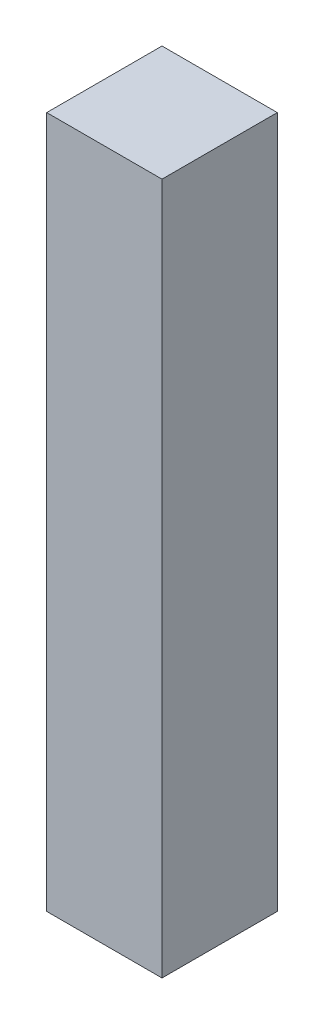
ISO-10303-21;
HEADER;
FILE_DESCRIPTION(('STEP AP214'),'2;1');
FILE_NAME('part.step','',(''),(''),'','','');
FILE_SCHEMA(('AUTOMOTIVE_DESIGN { 1 0 10303 214 1 1 1 1 }'));
ENDSEC;
DATA;
#1=APPLICATION_CONTEXT('core data for automotive mechanical design processes');
#2=APPLICATION_PROTOCOL_DEFINITION('international standard','automotive_design',2000,#1);
#3=PRODUCT_CONTEXT('',#1,'mechanical');
#4=PRODUCT('Part','Part','',(#3));
#5=PRODUCT_RELATED_PRODUCT_CATEGORY('part','',(#4));
#6=PRODUCT_DEFINITION_FORMATION('','',#4);
#7=PRODUCT_DEFINITION_CONTEXT('part definition',#1,'design');
#8=PRODUCT_DEFINITION('design','',#6,#7);
#9=PRODUCT_DEFINITION_SHAPE('','',#8);
#10=(LENGTH_UNIT() NAMED_UNIT(*) SI_UNIT(.MILLI.,.METRE.));
#11=(NAMED_UNIT(*) PLANE_ANGLE_UNIT() SI_UNIT($,.RADIAN.));
#12=(NAMED_UNIT(*) SI_UNIT($,.STERADIAN.) SOLID_ANGLE_UNIT());
#13=UNCERTAINTY_MEASURE_WITH_UNIT(LENGTH_MEASURE(1.E-05),#10,'distance_accuracy_value','');
#14=(GEOMETRIC_REPRESENTATION_CONTEXT(3) GLOBAL_UNCERTAINTY_ASSIGNED_CONTEXT((#13)) GLOBAL_UNIT_ASSIGNED_CONTEXT((#10,
#11,#12)) REPRESENTATION_CONTEXT('',''));
#15=CARTESIAN_POINT('',(0.,0.,0.));
#16=DIRECTION('',(0.,0.,1.));
#17=DIRECTION('',(1.,0.,0.));
#18=AXIS2_PLACEMENT_3D('',#15,#16,#17);
#19=CARTESIAN_POINT('',(0.2499995,1.49999954,0.));
#20=DIRECTION('',(1.,0.,0.));
#21=DIRECTION('',(0.,0.,-1.));
#22=AXIS2_PLACEMENT_3D('',#19,#20,#21);
#23=PLANE('',#22);
#24=DIRECTION('',(0.,0.,-1.));
#25=VECTOR('',#24,1.);
#26=CARTESIAN_POINT('',(0.2499995,-1.49999954,0.));
#27=LINE('',#26,#25);
#28=CARTESIAN_POINT('',(0.2499995,-1.49999954,0.));
#29=VERTEX_POINT('',#28);
#30=CARTESIAN_POINT('',(0.2499995,-1.49999954,0.499999));
#31=VERTEX_POINT('',#30);
#32=EDGE_CURVE('E20',#29,#31,#27,.F.);
#33=ORIENTED_EDGE('',*,*,#32,.F.);
#34=DIRECTION('',(0.,1.,0.));
#35=VECTOR('',#34,1.);
#36=CARTESIAN_POINT('',(0.2499995,-1.49999954,0.));
#37=LINE('',#36,#35);
#38=CARTESIAN_POINT('',(0.2499995,1.49999954,0.));
#39=VERTEX_POINT('',#38);
#40=EDGE_CURVE('E79',#29,#39,#37,.T.);
#41=ORIENTED_EDGE('',*,*,#40,.T.);
#42=DIRECTION('',(0.,0.,1.));
#43=VECTOR('',#42,1.);
#44=CARTESIAN_POINT('',(0.2499995,1.49999954,0.));
#45=LINE('',#44,#43);
#46=CARTESIAN_POINT('',(0.2499995,1.49999954,0.499999));
#47=VERTEX_POINT('',#46);
#48=EDGE_CURVE('E61',#47,#39,#45,.F.);
#49=ORIENTED_EDGE('',*,*,#48,.F.);
#50=DIRECTION('',(0.,1.,0.));
#51=VECTOR('',#50,1.);
#52=CARTESIAN_POINT('',(0.2499995,-1.49999954,0.499999));
#53=LINE('',#52,#51);
#54=EDGE_CURVE('E56',#31,#47,#53,.T.);
#55=ORIENTED_EDGE('',*,*,#54,.F.);
#56=EDGE_LOOP('',(#33,#41,#49,#55));
#57=FACE_BOUND('',#56,.T.);
#58=ADVANCED_FACE('F17',(#57),#23,.T.);
#59=CARTESIAN_POINT('',(0.2499995,-1.49999954,0.));
#60=DIRECTION('',(0.,-1.,0.));
#61=DIRECTION('',(0.,0.,-1.));
#62=AXIS2_PLACEMENT_3D('',#59,#60,#61);
#63=PLANE('',#62);
#64=DIRECTION('',(0.,0.,1.));
#65=VECTOR('',#64,1.);
#66=CARTESIAN_POINT('',(-0.2499995,-1.49999954,0.));
#67=LINE('',#66,#65);
#68=CARTESIAN_POINT('',(-0.2499995,-1.49999954,0.));
#69=VERTEX_POINT('',#68);
#70=CARTESIAN_POINT('',(-0.2499995,-1.49999954,0.499999));
#71=VERTEX_POINT('',#70);
#72=EDGE_CURVE('E83',#69,#71,#67,.T.);
#73=ORIENTED_EDGE('',*,*,#72,.F.);
#74=DIRECTION('',(1.,0.,0.));
#75=VECTOR('',#74,1.);
#76=CARTESIAN_POINT('',(0.2499995,-1.49999954,0.));
#77=LINE('',#76,#75);
#78=EDGE_CURVE('E68',#69,#29,#77,.T.);
#79=ORIENTED_EDGE('',*,*,#78,.T.);
#80=ORIENTED_EDGE('',*,*,#32,.T.);
#81=DIRECTION('',(1.,0.,0.));
#82=VECTOR('',#81,1.);
#83=CARTESIAN_POINT('',(0.2499995,-1.49999954,0.499999));
#84=LINE('',#83,#82);
#85=EDGE_CURVE('E63',#71,#31,#84,.T.);
#86=ORIENTED_EDGE('',*,*,#85,.F.);
#87=EDGE_LOOP('',(#73,#79,#80,#86));
#88=FACE_BOUND('',#87,.T.);
#89=ADVANCED_FACE('F65',(#88),#63,.T.);
#90=CARTESIAN_POINT('',(0.2499995,-1.49999954,0.499999));
#91=DIRECTION('',(0.,0.,1.));
#92=DIRECTION('',(1.,0.,0.));
#93=AXIS2_PLACEMENT_3D('',#90,#91,#92);
#94=PLANE('',#93);
#95=DIRECTION('',(0.,1.,0.));
#96=VECTOR('',#95,1.);
#97=CARTESIAN_POINT('',(-0.2499995,-1.49999954,0.499999));
#98=LINE('',#97,#96);
#99=CARTESIAN_POINT('',(-0.2499995,1.49999954,0.499999));
#100=VERTEX_POINT('',#99);
#101=EDGE_CURVE('E72',#71,#100,#98,.T.);
#102=ORIENTED_EDGE('',*,*,#101,.F.);
#103=ORIENTED_EDGE('',*,*,#85,.T.);
#104=ORIENTED_EDGE('',*,*,#54,.T.);
#105=DIRECTION('',(1.,0.,0.));
#106=VECTOR('',#105,1.);
#107=CARTESIAN_POINT('',(-0.2499995,1.49999954,0.499999));
#108=LINE('',#107,#106);
#109=EDGE_CURVE('E74',#100,#47,#108,.T.);
#110=ORIENTED_EDGE('',*,*,#109,.F.);
#111=EDGE_LOOP('',(#102,#103,#104,#110));
#112=FACE_BOUND('',#111,.T.);
#113=ADVANCED_FACE('F70',(#112),#94,.T.);
#114=CARTESIAN_POINT('',(-0.2499995,1.49999954,0.));
#115=DIRECTION('',(0.,1.,0.));
#116=DIRECTION('',(0.,0.,1.));
#117=AXIS2_PLACEMENT_3D('',#114,#115,#116);
#118=PLANE('',#117);
#119=ORIENTED_EDGE('',*,*,#48,.T.);
#120=DIRECTION('',(1.,0.,0.));
#121=VECTOR('',#120,1.);
#122=CARTESIAN_POINT('',(0.2499995,1.49999954,0.));
#123=LINE('',#122,#121);
#124=CARTESIAN_POINT('',(-0.2499995,1.49999954,0.));
#125=VERTEX_POINT('',#124);
#126=EDGE_CURVE('E35',#39,#125,#123,.F.);
#127=ORIENTED_EDGE('',*,*,#126,.T.);
#128=DIRECTION('',(0.,0.,1.));
#129=VECTOR('',#128,1.);
#130=CARTESIAN_POINT('',(-0.2499995,1.49999954,0.));
#131=LINE('',#130,#129);
#132=EDGE_CURVE('E26',#100,#125,#131,.F.);
#133=ORIENTED_EDGE('',*,*,#132,.F.);
#134=ORIENTED_EDGE('',*,*,#109,.T.);
#135=EDGE_LOOP('',(#119,#127,#133,#134));
#136=FACE_BOUND('',#135,.T.);
#137=ADVANCED_FACE('F89',(#136),#118,.T.);
#138=CARTESIAN_POINT('',(0.2499995,-1.49999954,0.));
#139=DIRECTION('',(0.,0.,1.));
#140=DIRECTION('',(1.,0.,0.));
#141=AXIS2_PLACEMENT_3D('',#138,#139,#140);
#142=PLANE('',#141);
#143=DIRECTION('',(0.,1.,0.));
#144=VECTOR('',#143,1.);
#145=CARTESIAN_POINT('',(-0.2499995,-1.49999954,0.));
#146=LINE('',#145,#144);
#147=EDGE_CURVE('E11',#125,#69,#146,.F.);
#148=ORIENTED_EDGE('',*,*,#147,.F.);
#149=ORIENTED_EDGE('',*,*,#126,.F.);
#150=ORIENTED_EDGE('',*,*,#40,.F.);
#151=ORIENTED_EDGE('',*,*,#78,.F.);
#152=EDGE_LOOP('',(#148,#149,#150,#151));
#153=FACE_BOUND('',#152,.T.);
#154=ADVANCED_FACE('F91',(#153),#142,.F.);
#155=CARTESIAN_POINT('',(-0.2499995,-1.49999954,0.));
#156=DIRECTION('',(-1.,0.,0.));
#157=DIRECTION('',(0.,0.,1.));
#158=AXIS2_PLACEMENT_3D('',#155,#156,#157);
#159=PLANE('',#158);
#160=ORIENTED_EDGE('',*,*,#132,.T.);
#161=ORIENTED_EDGE('',*,*,#147,.T.);
#162=ORIENTED_EDGE('',*,*,#72,.T.);
#163=ORIENTED_EDGE('',*,*,#101,.T.);
#164=EDGE_LOOP('',(#160,#161,#162,#163));
#165=FACE_BOUND('',#164,.T.);
#166=ADVANCED_FACE('F88',(#165),#159,.T.);
#167=CLOSED_SHELL('',(#58,#89,#113,#137,#154,#166));
#168=MANIFOLD_SOLID_BREP('B1',#167);
#169=ADVANCED_BREP_SHAPE_REPRESENTATION('',(#18,#168),#14);
#170=SHAPE_DEFINITION_REPRESENTATION(#9,#169);
ENDSEC;
END-ISO-10303-21;
